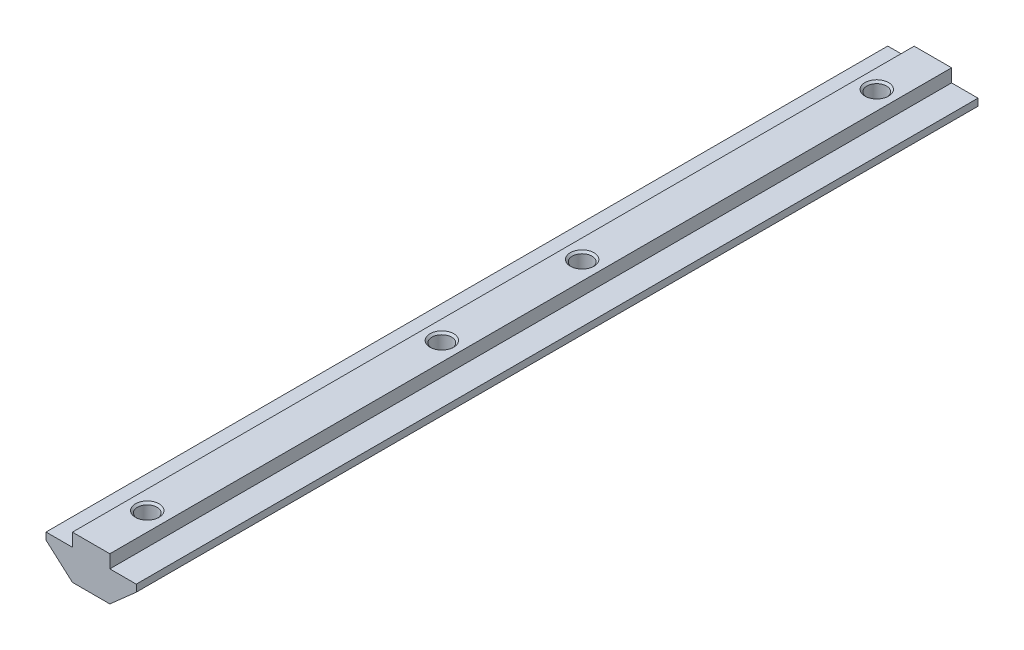
ISO-10303-21;
HEADER;
FILE_DESCRIPTION(('STEP AP214'),'2;1');
FILE_NAME('part.step','',(''),(''),'','','');
FILE_SCHEMA(('AUTOMOTIVE_DESIGN { 1 0 10303 214 1 1 1 1 }'));
ENDSEC;
DATA;
#1=APPLICATION_CONTEXT('core data for automotive mechanical design processes');
#2=APPLICATION_PROTOCOL_DEFINITION('international standard','automotive_design',2000,#1);
#3=PRODUCT_CONTEXT('',#1,'mechanical');
#4=PRODUCT('Part','Part','',(#3));
#5=PRODUCT_RELATED_PRODUCT_CATEGORY('part','',(#4));
#6=PRODUCT_DEFINITION_FORMATION('','',#4);
#7=PRODUCT_DEFINITION_CONTEXT('part definition',#1,'design');
#8=PRODUCT_DEFINITION('design','',#6,#7);
#9=PRODUCT_DEFINITION_SHAPE('','',#8);
#10=(LENGTH_UNIT() NAMED_UNIT(*) SI_UNIT(.MILLI.,.METRE.));
#11=(NAMED_UNIT(*) PLANE_ANGLE_UNIT() SI_UNIT($,.RADIAN.));
#12=(NAMED_UNIT(*) SI_UNIT($,.STERADIAN.) SOLID_ANGLE_UNIT());
#13=UNCERTAINTY_MEASURE_WITH_UNIT(LENGTH_MEASURE(1.E-05),#10,'distance_accuracy_value','');
#14=(GEOMETRIC_REPRESENTATION_CONTEXT(3) GLOBAL_UNCERTAINTY_ASSIGNED_CONTEXT((#13)) GLOBAL_UNIT_ASSIGNED_CONTEXT((#10,
#11,#12)) REPRESENTATION_CONTEXT('',''));
#15=CARTESIAN_POINT('',(0.,0.,0.));
#16=DIRECTION('',(0.,0.,1.));
#17=DIRECTION('',(1.,0.,0.));
#18=AXIS2_PLACEMENT_3D('',#15,#16,#17);
#19=CARTESIAN_POINT('',(-4.,0.,90.));
#20=DIRECTION('',(1.,0.,0.));
#21=DIRECTION('',(0.,0.,-1.));
#22=AXIS2_PLACEMENT_3D('',#19,#20,#21);
#23=PLANE('',#22);
#24=DIRECTION('',(0.,-1.,0.));
#25=VECTOR('',#24,1.);
#26=CARTESIAN_POINT('',(-4.,0.,-90.));
#27=LINE('',#26,#25);
#28=CARTESIAN_POINT('',(-4.,0.,-90.));
#29=VERTEX_POINT('',#28);
#30=CARTESIAN_POINT('',(-4.,-2.8,-90.));
#31=VERTEX_POINT('',#30);
#32=EDGE_CURVE('E145',#29,#31,#27,.T.);
#33=ORIENTED_EDGE('',*,*,#32,.T.);
#34=DIRECTION('',(0.,0.,-1.));
#35=VECTOR('',#34,1.);
#36=CARTESIAN_POINT('',(-4.,-2.8,90.));
#37=LINE('',#36,#35);
#38=CARTESIAN_POINT('',(-4.,-2.8,90.));
#39=VERTEX_POINT('',#38);
#40=EDGE_CURVE('E11',#39,#31,#37,.T.);
#41=ORIENTED_EDGE('',*,*,#40,.F.);
#42=DIRECTION('',(0.,-1.,0.));
#43=VECTOR('',#42,1.);
#44=CARTESIAN_POINT('',(-4.,0.,90.));
#45=LINE('',#44,#43);
#46=CARTESIAN_POINT('',(-4.,0.,90.));
#47=VERTEX_POINT('',#46);
#48=EDGE_CURVE('E164',#47,#39,#45,.T.);
#49=ORIENTED_EDGE('',*,*,#48,.F.);
#50=DIRECTION('',(0.,0.,-1.));
#51=VECTOR('',#50,1.);
#52=CARTESIAN_POINT('',(-4.,0.,90.));
#53=LINE('',#52,#51);
#54=EDGE_CURVE('E141',#47,#29,#53,.T.);
#55=ORIENTED_EDGE('',*,*,#54,.T.);
#56=EDGE_LOOP('',(#33,#41,#49,#55));
#57=FACE_BOUND('',#56,.T.);
#58=ADVANCED_FACE('F37',(#57),#23,.F.);
#59=CARTESIAN_POINT('',(-4.,-2.8,90.));
#60=DIRECTION('',(0.,-1.,0.));
#61=DIRECTION('',(1.,0.,0.));
#62=AXIS2_PLACEMENT_3D('',#59,#60,#61);
#63=PLANE('',#62);
#64=DIRECTION('',(-1.,0.,0.));
#65=VECTOR('',#64,1.);
#66=CARTESIAN_POINT('',(-4.,-2.8,-90.));
#67=LINE('',#66,#65);
#68=CARTESIAN_POINT('',(-9.65,-2.8,-90.));
#69=VERTEX_POINT('',#68);
#70=EDGE_CURVE('E148',#31,#69,#67,.T.);
#71=ORIENTED_EDGE('',*,*,#70,.T.);
#72=DIRECTION('',(0.,0.,-1.));
#73=VECTOR('',#72,1.);
#74=CARTESIAN_POINT('',(-9.65,-2.8,90.));
#75=LINE('',#74,#73);
#76=CARTESIAN_POINT('',(-9.65,-2.8,90.));
#77=VERTEX_POINT('',#76);
#78=EDGE_CURVE('E45',#77,#69,#75,.T.);
#79=ORIENTED_EDGE('',*,*,#78,.F.);
#80=DIRECTION('',(-1.,0.,0.));
#81=VECTOR('',#80,1.);
#82=CARTESIAN_POINT('',(-4.,-2.8,90.));
#83=LINE('',#82,#81);
#84=EDGE_CURVE('E102',#39,#77,#83,.T.);
#85=ORIENTED_EDGE('',*,*,#84,.F.);
#86=ORIENTED_EDGE('',*,*,#40,.T.);
#87=EDGE_LOOP('',(#71,#79,#85,#86));
#88=FACE_BOUND('',#87,.T.);
#89=ADVANCED_FACE('F308',(#88),#63,.F.);
#90=CARTESIAN_POINT('',(-9.65,-2.8,90.));
#91=DIRECTION('',(1.,0.,0.));
#92=DIRECTION('',(0.,0.,-1.));
#93=AXIS2_PLACEMENT_3D('',#90,#91,#92);
#94=PLANE('',#93);
#95=DIRECTION('',(0.,-1.,0.));
#96=VECTOR('',#95,1.);
#97=CARTESIAN_POINT('',(-9.65,-2.8,-90.));
#98=LINE('',#97,#96);
#99=CARTESIAN_POINT('',(-9.65,-4.3,-90.));
#100=VERTEX_POINT('',#99);
#101=EDGE_CURVE('E151',#69,#100,#98,.T.);
#102=ORIENTED_EDGE('',*,*,#101,.T.);
#103=DIRECTION('',(0.,0.,-1.));
#104=VECTOR('',#103,1.);
#105=CARTESIAN_POINT('',(-9.65,-4.3,90.));
#106=LINE('',#105,#104);
#107=CARTESIAN_POINT('',(-9.65,-4.3,90.));
#108=VERTEX_POINT('',#107);
#109=EDGE_CURVE('E177',#108,#100,#106,.T.);
#110=ORIENTED_EDGE('',*,*,#109,.F.);
#111=DIRECTION('',(0.,-1.,0.));
#112=VECTOR('',#111,1.);
#113=CARTESIAN_POINT('',(-9.65,-2.8,90.));
#114=LINE('',#113,#112);
#115=EDGE_CURVE('E185',#77,#108,#114,.T.);
#116=ORIENTED_EDGE('',*,*,#115,.F.);
#117=ORIENTED_EDGE('',*,*,#78,.T.);
#118=EDGE_LOOP('',(#102,#110,#116,#117));
#119=FACE_BOUND('',#118,.T.);
#120=ADVANCED_FACE('F183',(#119),#94,.F.);
#121=CARTESIAN_POINT('',(-9.65,-4.3,90.));
#122=DIRECTION('',(0.662716862978516,0.748870055165724,0.));
#123=DIRECTION('',(-0.748870055165724,0.662716862978517,0.));
#124=AXIS2_PLACEMENT_3D('',#121,#122,#123);
#125=PLANE('',#124);
#126=DIRECTION('',(0.748870055165724,-0.662716862978517,0.));
#127=VECTOR('',#126,1.);
#128=CARTESIAN_POINT('',(-9.65,-4.3,-90.));
#129=LINE('',#128,#127);
#130=CARTESIAN_POINT('',(-4.,-9.3,-90.));
#131=VERTEX_POINT('',#130);
#132=EDGE_CURVE('E153',#100,#131,#129,.T.);
#133=ORIENTED_EDGE('',*,*,#132,.T.);
#134=DIRECTION('',(0.,0.,-1.));
#135=VECTOR('',#134,1.);
#136=CARTESIAN_POINT('',(-4.,-9.3,90.));
#137=LINE('',#136,#135);
#138=CARTESIAN_POINT('',(-4.,-9.3,90.));
#139=VERTEX_POINT('',#138);
#140=EDGE_CURVE('E174',#139,#131,#137,.T.);
#141=ORIENTED_EDGE('',*,*,#140,.F.);
#142=DIRECTION('',(0.748870055165724,-0.662716862978517,0.));
#143=VECTOR('',#142,1.);
#144=CARTESIAN_POINT('',(-9.65,-4.3,90.));
#145=LINE('',#144,#143);
#146=EDGE_CURVE('E203',#108,#139,#145,.T.);
#147=ORIENTED_EDGE('',*,*,#146,.F.);
#148=ORIENTED_EDGE('',*,*,#109,.T.);
#149=EDGE_LOOP('',(#133,#141,#147,#148));
#150=FACE_BOUND('',#149,.T.);
#151=ADVANCED_FACE('F194',(#150),#125,.F.);
#152=CARTESIAN_POINT('',(-4.,-9.3,90.));
#153=DIRECTION('',(0.,1.,0.));
#154=DIRECTION('',(0.,0.,1.));
#155=AXIS2_PLACEMENT_3D('',#152,#153,#154);
#156=PLANE('',#155);
#157=CARTESIAN_POINT('',(0.,-9.3,-78.));
#158=DIRECTION('',(0.,1.,0.));
#159=DIRECTION('',(0.,0.,1.));
#160=AXIS2_PLACEMENT_3D('',#157,#158,#159);
#161=CIRCLE('',#160,2.525);
#162=CARTESIAN_POINT('',(0.,-9.3,-75.475));
#163=VERTEX_POINT('',#162);
#164=EDGE_CURVE('E255',#163,#163,#161,.T.);
#165=ORIENTED_EDGE('',*,*,#164,.T.);
#166=EDGE_LOOP('',(#165));
#167=FACE_BOUND('',#166,.T.);
#168=CARTESIAN_POINT('',(0.,-9.3,-15.));
#169=DIRECTION('',(0.,1.,0.));
#170=DIRECTION('',(0.,0.,1.));
#171=AXIS2_PLACEMENT_3D('',#168,#169,#170);
#172=CIRCLE('',#171,2.525);
#173=CARTESIAN_POINT('',(0.,-9.3,-12.475));
#174=VERTEX_POINT('',#173);
#175=EDGE_CURVE('E243',#174,#174,#172,.T.);
#176=ORIENTED_EDGE('',*,*,#175,.T.);
#177=EDGE_LOOP('',(#176));
#178=FACE_BOUND('',#177,.T.);
#179=CARTESIAN_POINT('',(0.,-9.3,15.));
#180=DIRECTION('',(0.,1.,0.));
#181=DIRECTION('',(0.,0.,1.));
#182=AXIS2_PLACEMENT_3D('',#179,#180,#181);
#183=CIRCLE('',#182,2.525);
#184=CARTESIAN_POINT('',(0.,-9.3,17.525));
#185=VERTEX_POINT('',#184);
#186=EDGE_CURVE('E231',#185,#185,#183,.T.);
#187=ORIENTED_EDGE('',*,*,#186,.T.);
#188=EDGE_LOOP('',(#187));
#189=FACE_BOUND('',#188,.T.);
#190=CARTESIAN_POINT('',(0.,-9.3,78.));
#191=DIRECTION('',(0.,1.,0.));
#192=DIRECTION('',(0.,0.,1.));
#193=AXIS2_PLACEMENT_3D('',#190,#191,#192);
#194=CIRCLE('',#193,2.525);
#195=CARTESIAN_POINT('',(0.,-9.3,80.525));
#196=VERTEX_POINT('',#195);
#197=EDGE_CURVE('E219',#196,#196,#194,.T.);
#198=ORIENTED_EDGE('',*,*,#197,.T.);
#199=EDGE_LOOP('',(#198));
#200=FACE_BOUND('',#199,.T.);
#201=DIRECTION('',(1.,0.,0.));
#202=VECTOR('',#201,1.);
#203=CARTESIAN_POINT('',(-4.,-9.3,-90.));
#204=LINE('',#203,#202);
#205=CARTESIAN_POINT('',(4.,-9.3,-90.));
#206=VERTEX_POINT('',#205);
#207=EDGE_CURVE('E155',#131,#206,#204,.T.);
#208=ORIENTED_EDGE('',*,*,#207,.T.);
#209=DIRECTION('',(0.,0.,-1.));
#210=VECTOR('',#209,1.);
#211=CARTESIAN_POINT('',(4.,-9.3,90.));
#212=LINE('',#211,#210);
#213=CARTESIAN_POINT('',(4.,-9.3,90.));
#214=VERTEX_POINT('',#213);
#215=EDGE_CURVE('E171',#214,#206,#212,.T.);
#216=ORIENTED_EDGE('',*,*,#215,.F.);
#217=DIRECTION('',(1.,0.,0.));
#218=VECTOR('',#217,1.);
#219=CARTESIAN_POINT('',(-4.,-9.3,90.));
#220=LINE('',#219,#218);
#221=EDGE_CURVE('E200',#139,#214,#220,.T.);
#222=ORIENTED_EDGE('',*,*,#221,.F.);
#223=ORIENTED_EDGE('',*,*,#140,.T.);
#224=EDGE_LOOP('',(#208,#216,#222,#223));
#225=FACE_BOUND('',#224,.T.);
#226=ADVANCED_FACE('F198',(#167,#178,#189,#200,#225),#156,.F.);
#227=CARTESIAN_POINT('',(9.65,-4.3,90.));
#228=DIRECTION('',(-0.662716862978516,0.748870055165724,0.));
#229=DIRECTION('',(-0.748870055165724,-0.662716862978517,0.));
#230=AXIS2_PLACEMENT_3D('',#227,#228,#229);
#231=PLANE('',#230);
#232=DIRECTION('',(0.748870055165724,0.662716862978517,0.));
#233=VECTOR('',#232,1.);
#234=CARTESIAN_POINT('',(9.65,-4.3,-90.));
#235=LINE('',#234,#233);
#236=CARTESIAN_POINT('',(9.65,-4.3,-90.));
#237=VERTEX_POINT('',#236);
#238=EDGE_CURVE('E157',#206,#237,#235,.T.);
#239=ORIENTED_EDGE('',*,*,#238,.T.);
#240=DIRECTION('',(0.,0.,-1.));
#241=VECTOR('',#240,1.);
#242=CARTESIAN_POINT('',(9.65,-4.3,90.));
#243=LINE('',#242,#241);
#244=CARTESIAN_POINT('',(9.65,-4.3,90.));
#245=VERTEX_POINT('',#244);
#246=EDGE_CURVE('E168',#245,#237,#243,.T.);
#247=ORIENTED_EDGE('',*,*,#246,.F.);
#248=DIRECTION('',(0.748870055165724,0.662716862978517,0.));
#249=VECTOR('',#248,1.);
#250=CARTESIAN_POINT('',(9.65,-4.3,90.));
#251=LINE('',#250,#249);
#252=EDGE_CURVE('E202',#214,#245,#251,.T.);
#253=ORIENTED_EDGE('',*,*,#252,.F.);
#254=ORIENTED_EDGE('',*,*,#215,.T.);
#255=EDGE_LOOP('',(#239,#247,#253,#254));
#256=FACE_BOUND('',#255,.T.);
#257=ADVANCED_FACE('F320',(#256),#231,.F.);
#258=CARTESIAN_POINT('',(9.65,-2.8,90.));
#259=DIRECTION('',(-1.,0.,0.));
#260=DIRECTION('',(0.,0.,1.));
#261=AXIS2_PLACEMENT_3D('',#258,#259,#260);
#262=PLANE('',#261);
#263=DIRECTION('',(0.,1.,0.));
#264=VECTOR('',#263,1.);
#265=CARTESIAN_POINT('',(9.65,-2.8,-90.));
#266=LINE('',#265,#264);
#267=CARTESIAN_POINT('',(9.65,-2.8,-90.));
#268=VERTEX_POINT('',#267);
#269=EDGE_CURVE('E159',#237,#268,#266,.T.);
#270=ORIENTED_EDGE('',*,*,#269,.T.);
#271=DIRECTION('',(0.,0.,-1.));
#272=VECTOR('',#271,1.);
#273=CARTESIAN_POINT('',(9.65,-2.8,90.));
#274=LINE('',#273,#272);
#275=CARTESIAN_POINT('',(9.65,-2.8,90.));
#276=VERTEX_POINT('',#275);
#277=EDGE_CURVE('E136',#276,#268,#274,.T.);
#278=ORIENTED_EDGE('',*,*,#277,.F.);
#279=DIRECTION('',(0.,1.,0.));
#280=VECTOR('',#279,1.);
#281=CARTESIAN_POINT('',(9.65,-2.8,90.));
#282=LINE('',#281,#280);
#283=EDGE_CURVE('E127',#245,#276,#282,.T.);
#284=ORIENTED_EDGE('',*,*,#283,.F.);
#285=ORIENTED_EDGE('',*,*,#246,.T.);
#286=EDGE_LOOP('',(#270,#278,#284,#285));
#287=FACE_BOUND('',#286,.T.);
#288=ADVANCED_FACE('F317',(#287),#262,.F.);
#289=CARTESIAN_POINT('',(4.,-2.8,90.));
#290=DIRECTION('',(0.,-1.,0.));
#291=DIRECTION('',(1.,0.,0.));
#292=AXIS2_PLACEMENT_3D('',#289,#290,#291);
#293=PLANE('',#292);
#294=DIRECTION('',(-1.,0.,0.));
#295=VECTOR('',#294,1.);
#296=CARTESIAN_POINT('',(4.,-2.8,-90.));
#297=LINE('',#296,#295);
#298=CARTESIAN_POINT('',(4.,-2.8,-90.));
#299=VERTEX_POINT('',#298);
#300=EDGE_CURVE('E135',#268,#299,#297,.T.);
#301=ORIENTED_EDGE('',*,*,#300,.T.);
#302=DIRECTION('',(0.,0.,-1.));
#303=VECTOR('',#302,1.);
#304=CARTESIAN_POINT('',(4.,-2.8,90.));
#305=LINE('',#304,#303);
#306=CARTESIAN_POINT('',(4.,-2.8,90.));
#307=VERTEX_POINT('',#306);
#308=EDGE_CURVE('E132',#307,#299,#305,.T.);
#309=ORIENTED_EDGE('',*,*,#308,.F.);
#310=DIRECTION('',(-1.,0.,0.));
#311=VECTOR('',#310,1.);
#312=CARTESIAN_POINT('',(4.,-2.8,90.));
#313=LINE('',#312,#311);
#314=EDGE_CURVE('E121',#276,#307,#313,.T.);
#315=ORIENTED_EDGE('',*,*,#314,.F.);
#316=ORIENTED_EDGE('',*,*,#277,.T.);
#317=EDGE_LOOP('',(#301,#309,#315,#316));
#318=FACE_BOUND('',#317,.T.);
#319=ADVANCED_FACE('F133',(#318),#293,.F.);
#320=CARTESIAN_POINT('',(4.,0.,90.));
#321=DIRECTION('',(-1.,0.,0.));
#322=DIRECTION('',(0.,0.,1.));
#323=AXIS2_PLACEMENT_3D('',#320,#321,#322);
#324=PLANE('',#323);
#325=DIRECTION('',(0.,1.,0.));
#326=VECTOR('',#325,1.);
#327=CARTESIAN_POINT('',(4.,0.,-90.));
#328=LINE('',#327,#326);
#329=CARTESIAN_POINT('',(4.,0.,-90.));
#330=VERTEX_POINT('',#329);
#331=EDGE_CURVE('E88',#299,#330,#328,.T.);
#332=ORIENTED_EDGE('',*,*,#331,.T.);
#333=DIRECTION('',(0.,0.,-1.));
#334=VECTOR('',#333,1.);
#335=CARTESIAN_POINT('',(4.,0.,90.));
#336=LINE('',#335,#334);
#337=CARTESIAN_POINT('',(4.,0.,90.));
#338=VERTEX_POINT('',#337);
#339=EDGE_CURVE('E137',#338,#330,#336,.T.);
#340=ORIENTED_EDGE('',*,*,#339,.F.);
#341=DIRECTION('',(0.,1.,0.));
#342=VECTOR('',#341,1.);
#343=CARTESIAN_POINT('',(4.,0.,90.));
#344=LINE('',#343,#342);
#345=EDGE_CURVE('E125',#307,#338,#344,.T.);
#346=ORIENTED_EDGE('',*,*,#345,.F.);
#347=ORIENTED_EDGE('',*,*,#308,.T.);
#348=EDGE_LOOP('',(#332,#340,#346,#347));
#349=FACE_BOUND('',#348,.T.);
#350=ADVANCED_FACE('F139',(#349),#324,.F.);
#351=CARTESIAN_POINT('',(4.,0.,90.));
#352=DIRECTION('',(0.,-1.,0.));
#353=DIRECTION('',(0.,0.,-1.));
#354=AXIS2_PLACEMENT_3D('',#351,#352,#353);
#355=PLANE('',#354);
#356=CARTESIAN_POINT('',(0.,0.,-78.));
#357=DIRECTION('',(0.,1.,0.));
#358=DIRECTION('',(0.,0.,1.));
#359=AXIS2_PLACEMENT_3D('',#356,#357,#358);
#360=CIRCLE('',#359,2.525);
#361=CARTESIAN_POINT('',(0.,0.,-75.475));
#362=VERTEX_POINT('',#361);
#363=EDGE_CURVE('E252',#362,#362,#360,.T.);
#364=ORIENTED_EDGE('',*,*,#363,.F.);
#365=EDGE_LOOP('',(#364));
#366=FACE_BOUND('',#365,.T.);
#367=CARTESIAN_POINT('',(0.,0.,-15.));
#368=DIRECTION('',(0.,1.,0.));
#369=DIRECTION('',(0.,0.,1.));
#370=AXIS2_PLACEMENT_3D('',#367,#368,#369);
#371=CIRCLE('',#370,2.525);
#372=CARTESIAN_POINT('',(0.,0.,-12.475));
#373=VERTEX_POINT('',#372);
#374=EDGE_CURVE('E240',#373,#373,#371,.T.);
#375=ORIENTED_EDGE('',*,*,#374,.F.);
#376=EDGE_LOOP('',(#375));
#377=FACE_BOUND('',#376,.T.);
#378=CARTESIAN_POINT('',(0.,0.,15.));
#379=DIRECTION('',(0.,1.,0.));
#380=DIRECTION('',(0.,0.,1.));
#381=AXIS2_PLACEMENT_3D('',#378,#379,#380);
#382=CIRCLE('',#381,2.525);
#383=CARTESIAN_POINT('',(0.,0.,17.525));
#384=VERTEX_POINT('',#383);
#385=EDGE_CURVE('E228',#384,#384,#382,.T.);
#386=ORIENTED_EDGE('',*,*,#385,.F.);
#387=EDGE_LOOP('',(#386));
#388=FACE_BOUND('',#387,.T.);
#389=CARTESIAN_POINT('',(0.,0.,78.));
#390=DIRECTION('',(0.,1.,0.));
#391=DIRECTION('',(0.,0.,1.));
#392=AXIS2_PLACEMENT_3D('',#389,#390,#391);
#393=CIRCLE('',#392,2.525);
#394=CARTESIAN_POINT('',(0.,0.,80.525));
#395=VERTEX_POINT('',#394);
#396=EDGE_CURVE('E216',#395,#395,#393,.T.);
#397=ORIENTED_EDGE('',*,*,#396,.F.);
#398=EDGE_LOOP('',(#397));
#399=FACE_BOUND('',#398,.T.);
#400=DIRECTION('',(-1.,0.,0.));
#401=VECTOR('',#400,1.);
#402=CARTESIAN_POINT('',(4.,0.,-90.));
#403=LINE('',#402,#401);
#404=EDGE_CURVE('E94',#330,#29,#403,.T.);
#405=ORIENTED_EDGE('',*,*,#404,.T.);
#406=ORIENTED_EDGE('',*,*,#54,.F.);
#407=DIRECTION('',(-1.,0.,0.));
#408=VECTOR('',#407,1.);
#409=CARTESIAN_POINT('',(4.,0.,90.));
#410=LINE('',#409,#408);
#411=EDGE_CURVE('E53',#338,#47,#410,.T.);
#412=ORIENTED_EDGE('',*,*,#411,.F.);
#413=ORIENTED_EDGE('',*,*,#339,.T.);
#414=EDGE_LOOP('',(#405,#406,#412,#413));
#415=FACE_BOUND('',#414,.T.);
#416=ADVANCED_FACE('F280',(#366,#377,#388,#399,#415),#355,.F.);
#417=CARTESIAN_POINT('',(0.,0.,90.));
#418=DIRECTION('',(0.,0.,-1.));
#419=DIRECTION('',(-1.,0.,0.));
#420=AXIS2_PLACEMENT_3D('',#417,#418,#419);
#421=PLANE('',#420);
#422=ORIENTED_EDGE('',*,*,#48,.T.);
#423=ORIENTED_EDGE('',*,*,#84,.T.);
#424=ORIENTED_EDGE('',*,*,#115,.T.);
#425=ORIENTED_EDGE('',*,*,#146,.T.);
#426=ORIENTED_EDGE('',*,*,#221,.T.);
#427=ORIENTED_EDGE('',*,*,#252,.T.);
#428=ORIENTED_EDGE('',*,*,#283,.T.);
#429=ORIENTED_EDGE('',*,*,#314,.T.);
#430=ORIENTED_EDGE('',*,*,#345,.T.);
#431=ORIENTED_EDGE('',*,*,#411,.T.);
#432=EDGE_LOOP('',(#422,#423,#424,#425,#426,#427,#428,#429,#430,#431));
#433=FACE_BOUND('',#432,.T.);
#434=ADVANCED_FACE('F123',(#433),#421,.F.);
#435=CARTESIAN_POINT('',(0.,0.,-90.));
#436=DIRECTION('',(0.,0.,-1.));
#437=DIRECTION('',(-1.,0.,0.));
#438=AXIS2_PLACEMENT_3D('',#435,#436,#437);
#439=PLANE('',#438);
#440=ORIENTED_EDGE('',*,*,#32,.F.);
#441=ORIENTED_EDGE('',*,*,#404,.F.);
#442=ORIENTED_EDGE('',*,*,#331,.F.);
#443=ORIENTED_EDGE('',*,*,#300,.F.);
#444=ORIENTED_EDGE('',*,*,#269,.F.);
#445=ORIENTED_EDGE('',*,*,#238,.F.);
#446=ORIENTED_EDGE('',*,*,#207,.F.);
#447=ORIENTED_EDGE('',*,*,#132,.F.);
#448=ORIENTED_EDGE('',*,*,#101,.F.);
#449=ORIENTED_EDGE('',*,*,#70,.F.);
#450=EDGE_LOOP('',(#440,#441,#442,#443,#444,#445,#446,#447,#448,#449));
#451=FACE_BOUND('',#450,.T.);
#452=ADVANCED_FACE('F189',(#451),#439,.T.);
#453=CARTESIAN_POINT('',(0.,-8.875,78.));
#454=DIRECTION('',(0.,-1.,0.));
#455=DIRECTION('',(0.,0.,-1.));
#456=AXIS2_PLACEMENT_3D('',#453,#454,#455);
#457=CONICAL_SURFACE('',#456,2.1,0.785398163397447);
#458=ORIENTED_EDGE('',*,*,#197,.F.);
#459=EDGE_LOOP('',(#458));
#460=FACE_BOUND('',#459,.T.);
#461=CARTESIAN_POINT('',(0.,-8.875,78.));
#462=DIRECTION('',(0.,1.,0.));
#463=DIRECTION('',(0.,0.,1.));
#464=AXIS2_PLACEMENT_3D('',#461,#462,#463);
#465=CIRCLE('',#464,2.1);
#466=CARTESIAN_POINT('',(0.,-8.875,80.1));
#467=VERTEX_POINT('',#466);
#468=EDGE_CURVE('E149',#467,#467,#465,.T.);
#469=ORIENTED_EDGE('',*,*,#468,.T.);
#470=EDGE_LOOP('',(#469));
#471=FACE_BOUND('',#470,.T.);
#472=ADVANCED_FACE('F303',(#460,#471),#457,.F.);
#473=CARTESIAN_POINT('',(0.,0.,78.));
#474=DIRECTION('',(0.,1.,0.));
#475=DIRECTION('',(0.,0.,1.));
#476=AXIS2_PLACEMENT_3D('',#473,#474,#475);
#477=CYLINDRICAL_SURFACE('',#476,2.09999999999999);
#478=ORIENTED_EDGE('',*,*,#468,.F.);
#479=EDGE_LOOP('',(#478));
#480=FACE_BOUND('',#479,.T.);
#481=CARTESIAN_POINT('',(0.,-0.424999999999995,78.));
#482=DIRECTION('',(0.,1.,0.));
#483=DIRECTION('',(0.,0.,1.));
#484=AXIS2_PLACEMENT_3D('',#481,#482,#483);
#485=CIRCLE('',#484,2.09999999999999);
#486=CARTESIAN_POINT('',(0.,-0.424999999999995,80.1));
#487=VERTEX_POINT('',#486);
#488=EDGE_CURVE('E213',#487,#487,#485,.T.);
#489=ORIENTED_EDGE('',*,*,#488,.T.);
#490=EDGE_LOOP('',(#489));
#491=FACE_BOUND('',#490,.T.);
#492=ADVANCED_FACE('F293',(#480,#491),#477,.F.);
#493=CARTESIAN_POINT('',(0.,0.,78.));
#494=DIRECTION('',(0.,1.,0.));
#495=DIRECTION('',(0.,0.,1.));
#496=AXIS2_PLACEMENT_3D('',#493,#494,#495);
#497=CONICAL_SURFACE('',#496,2.525,0.785398163397467);
#498=ORIENTED_EDGE('',*,*,#488,.F.);
#499=EDGE_LOOP('',(#498));
#500=FACE_BOUND('',#499,.T.);
#501=ORIENTED_EDGE('',*,*,#396,.T.);
#502=EDGE_LOOP('',(#501));
#503=FACE_BOUND('',#502,.T.);
#504=ADVANCED_FACE('F290',(#500,#503),#497,.F.);
#505=CARTESIAN_POINT('',(0.,-8.875,15.));
#506=DIRECTION('',(0.,-1.,0.));
#507=DIRECTION('',(0.,0.,-1.));
#508=AXIS2_PLACEMENT_3D('',#505,#506,#507);
#509=CONICAL_SURFACE('',#508,2.1,0.785398163397447);
#510=ORIENTED_EDGE('',*,*,#186,.F.);
#511=EDGE_LOOP('',(#510));
#512=FACE_BOUND('',#511,.T.);
#513=CARTESIAN_POINT('',(0.,-8.875,15.));
#514=DIRECTION('',(0.,1.,0.));
#515=DIRECTION('',(0.,0.,1.));
#516=AXIS2_PLACEMENT_3D('',#513,#514,#515);
#517=CIRCLE('',#516,2.1);
#518=CARTESIAN_POINT('',(0.,-8.875,17.1));
#519=VERTEX_POINT('',#518);
#520=EDGE_CURVE('E222',#519,#519,#517,.T.);
#521=ORIENTED_EDGE('',*,*,#520,.T.);
#522=EDGE_LOOP('',(#521));
#523=FACE_BOUND('',#522,.T.);
#524=ADVANCED_FACE('F292',(#512,#523),#509,.F.);
#525=CARTESIAN_POINT('',(0.,0.,15.));
#526=DIRECTION('',(0.,1.,0.));
#527=DIRECTION('',(0.,0.,1.));
#528=AXIS2_PLACEMENT_3D('',#525,#526,#527);
#529=CYLINDRICAL_SURFACE('',#528,2.09999999999999);
#530=ORIENTED_EDGE('',*,*,#520,.F.);
#531=EDGE_LOOP('',(#530));
#532=FACE_BOUND('',#531,.T.);
#533=CARTESIAN_POINT('',(0.,-0.424999999999995,15.));
#534=DIRECTION('',(0.,1.,0.));
#535=DIRECTION('',(0.,0.,1.));
#536=AXIS2_PLACEMENT_3D('',#533,#534,#535);
#537=CIRCLE('',#536,2.09999999999999);
#538=CARTESIAN_POINT('',(0.,-0.424999999999995,17.1));
#539=VERTEX_POINT('',#538);
#540=EDGE_CURVE('E225',#539,#539,#537,.T.);
#541=ORIENTED_EDGE('',*,*,#540,.T.);
#542=EDGE_LOOP('',(#541));
#543=FACE_BOUND('',#542,.T.);
#544=ADVANCED_FACE('F300',(#532,#543),#529,.F.);
#545=CARTESIAN_POINT('',(0.,0.,15.));
#546=DIRECTION('',(0.,1.,0.));
#547=DIRECTION('',(0.,0.,1.));
#548=AXIS2_PLACEMENT_3D('',#545,#546,#547);
#549=CONICAL_SURFACE('',#548,2.525,0.785398163397467);
#550=ORIENTED_EDGE('',*,*,#540,.F.);
#551=EDGE_LOOP('',(#550));
#552=FACE_BOUND('',#551,.T.);
#553=ORIENTED_EDGE('',*,*,#385,.T.);
#554=EDGE_LOOP('',(#553));
#555=FACE_BOUND('',#554,.T.);
#556=ADVANCED_FACE('F400',(#552,#555),#549,.F.);
#557=CARTESIAN_POINT('',(0.,-8.875,-15.));
#558=DIRECTION('',(0.,-1.,0.));
#559=DIRECTION('',(0.,0.,-1.));
#560=AXIS2_PLACEMENT_3D('',#557,#558,#559);
#561=CONICAL_SURFACE('',#560,2.1,0.785398163397447);
#562=ORIENTED_EDGE('',*,*,#175,.F.);
#563=EDGE_LOOP('',(#562));
#564=FACE_BOUND('',#563,.T.);
#565=CARTESIAN_POINT('',(0.,-8.875,-15.));
#566=DIRECTION('',(0.,1.,0.));
#567=DIRECTION('',(0.,0.,1.));
#568=AXIS2_PLACEMENT_3D('',#565,#566,#567);
#569=CIRCLE('',#568,2.1);
#570=CARTESIAN_POINT('',(0.,-8.875,-12.9));
#571=VERTEX_POINT('',#570);
#572=EDGE_CURVE('E234',#571,#571,#569,.T.);
#573=ORIENTED_EDGE('',*,*,#572,.T.);
#574=EDGE_LOOP('',(#573));
#575=FACE_BOUND('',#574,.T.);
#576=ADVANCED_FACE('F410',(#564,#575),#561,.F.);
#577=CARTESIAN_POINT('',(0.,0.,-15.));
#578=DIRECTION('',(0.,1.,0.));
#579=DIRECTION('',(0.,0.,1.));
#580=AXIS2_PLACEMENT_3D('',#577,#578,#579);
#581=CYLINDRICAL_SURFACE('',#580,2.09999999999999);
#582=ORIENTED_EDGE('',*,*,#572,.F.);
#583=EDGE_LOOP('',(#582));
#584=FACE_BOUND('',#583,.T.);
#585=CARTESIAN_POINT('',(0.,-0.424999999999995,-15.));
#586=DIRECTION('',(0.,1.,0.));
#587=DIRECTION('',(0.,0.,1.));
#588=AXIS2_PLACEMENT_3D('',#585,#586,#587);
#589=CIRCLE('',#588,2.09999999999999);
#590=CARTESIAN_POINT('',(0.,-0.424999999999995,-12.9));
#591=VERTEX_POINT('',#590);
#592=EDGE_CURVE('E237',#591,#591,#589,.T.);
#593=ORIENTED_EDGE('',*,*,#592,.T.);
#594=EDGE_LOOP('',(#593));
#595=FACE_BOUND('',#594,.T.);
#596=ADVANCED_FACE('F420',(#584,#595),#581,.F.);
#597=CARTESIAN_POINT('',(0.,0.,-15.));
#598=DIRECTION('',(0.,1.,0.));
#599=DIRECTION('',(0.,0.,1.));
#600=AXIS2_PLACEMENT_3D('',#597,#598,#599);
#601=CONICAL_SURFACE('',#600,2.525,0.785398163397467);
#602=ORIENTED_EDGE('',*,*,#592,.F.);
#603=EDGE_LOOP('',(#602));
#604=FACE_BOUND('',#603,.T.);
#605=ORIENTED_EDGE('',*,*,#374,.T.);
#606=EDGE_LOOP('',(#605));
#607=FACE_BOUND('',#606,.T.);
#608=ADVANCED_FACE('F265',(#604,#607),#601,.F.);
#609=CARTESIAN_POINT('',(0.,-8.875,-78.));
#610=DIRECTION('',(0.,-1.,0.));
#611=DIRECTION('',(0.,0.,-1.));
#612=AXIS2_PLACEMENT_3D('',#609,#610,#611);
#613=CONICAL_SURFACE('',#612,2.1,0.785398163397447);
#614=ORIENTED_EDGE('',*,*,#164,.F.);
#615=EDGE_LOOP('',(#614));
#616=FACE_BOUND('',#615,.T.);
#617=CARTESIAN_POINT('',(0.,-8.875,-78.));
#618=DIRECTION('',(0.,1.,0.));
#619=DIRECTION('',(0.,0.,1.));
#620=AXIS2_PLACEMENT_3D('',#617,#618,#619);
#621=CIRCLE('',#620,2.1);
#622=CARTESIAN_POINT('',(0.,-8.875,-75.9));
#623=VERTEX_POINT('',#622);
#624=EDGE_CURVE('E246',#623,#623,#621,.T.);
#625=ORIENTED_EDGE('',*,*,#624,.T.);
#626=EDGE_LOOP('',(#625));
#627=FACE_BOUND('',#626,.T.);
#628=ADVANCED_FACE('F261',(#616,#627),#613,.F.);
#629=CARTESIAN_POINT('',(0.,0.,-78.));
#630=DIRECTION('',(0.,1.,0.));
#631=DIRECTION('',(0.,0.,1.));
#632=AXIS2_PLACEMENT_3D('',#629,#630,#631);
#633=CYLINDRICAL_SURFACE('',#632,2.09999999999999);
#634=ORIENTED_EDGE('',*,*,#624,.F.);
#635=EDGE_LOOP('',(#634));
#636=FACE_BOUND('',#635,.T.);
#637=CARTESIAN_POINT('',(0.,-0.424999999999995,-78.));
#638=DIRECTION('',(0.,1.,0.));
#639=DIRECTION('',(0.,0.,1.));
#640=AXIS2_PLACEMENT_3D('',#637,#638,#639);
#641=CIRCLE('',#640,2.09999999999999);
#642=CARTESIAN_POINT('',(0.,-0.424999999999995,-75.9));
#643=VERTEX_POINT('',#642);
#644=EDGE_CURVE('E249',#643,#643,#641,.T.);
#645=ORIENTED_EDGE('',*,*,#644,.T.);
#646=EDGE_LOOP('',(#645));
#647=FACE_BOUND('',#646,.T.);
#648=ADVANCED_FACE('F264',(#636,#647),#633,.F.);
#649=CARTESIAN_POINT('',(0.,0.,-78.));
#650=DIRECTION('',(0.,1.,0.));
#651=DIRECTION('',(0.,0.,1.));
#652=AXIS2_PLACEMENT_3D('',#649,#650,#651);
#653=CONICAL_SURFACE('',#652,2.525,0.785398163397467);
#654=ORIENTED_EDGE('',*,*,#644,.F.);
#655=EDGE_LOOP('',(#654));
#656=FACE_BOUND('',#655,.T.);
#657=ORIENTED_EDGE('',*,*,#363,.T.);
#658=EDGE_LOOP('',(#657));
#659=FACE_BOUND('',#658,.T.);
#660=ADVANCED_FACE('F271',(#656,#659),#653,.F.);
#661=CLOSED_SHELL('',(#58,#89,#120,#151,#226,#257,#288,#319,#350,#416,#434,#452,#472,#492,#504,
#524,#544,#556,#576,#596,#608,#628,#648,#660));
#662=MANIFOLD_SOLID_BREP('B2',#661);
#663=ADVANCED_BREP_SHAPE_REPRESENTATION('',(#18,#662),#14);
#664=SHAPE_DEFINITION_REPRESENTATION(#9,#663);
ENDSEC;
END-ISO-10303-21;
